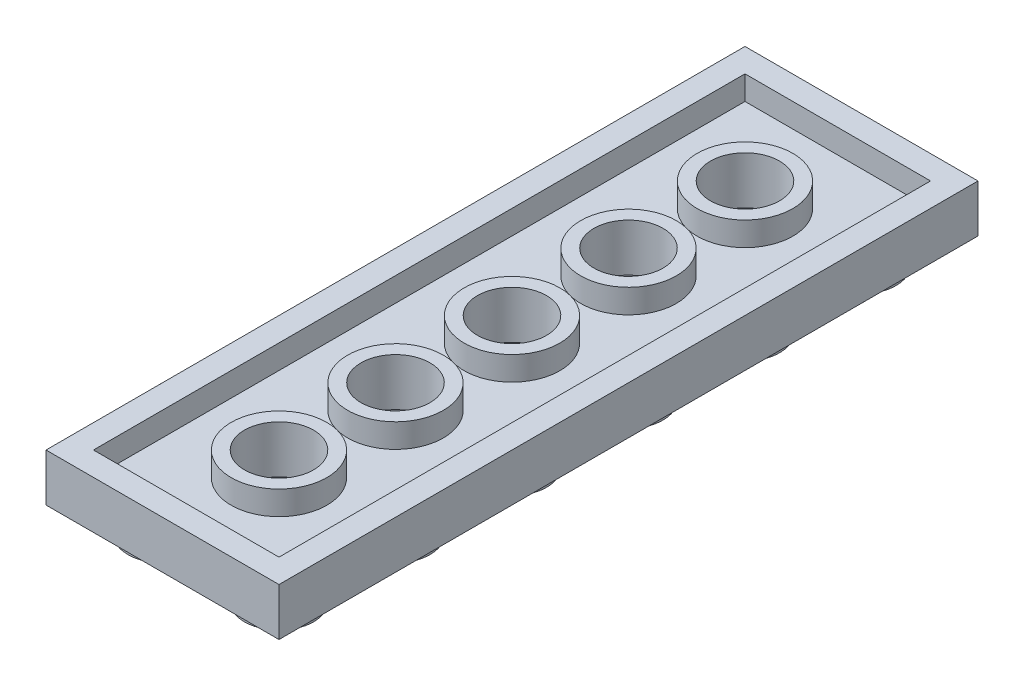
ISO-10303-21;
HEADER;
FILE_DESCRIPTION(('STEP AP214'),'2;1');
FILE_NAME('part.step','',(''),(''),'','','');
FILE_SCHEMA(('AUTOMOTIVE_DESIGN { 1 0 10303 214 1 1 1 1 }'));
ENDSEC;
DATA;
#1=APPLICATION_CONTEXT('core data for automotive mechanical design processes');
#2=APPLICATION_PROTOCOL_DEFINITION('international standard','automotive_design',2000,#1);
#3=PRODUCT_CONTEXT('',#1,'mechanical');
#4=PRODUCT('Part','Part','',(#3));
#5=PRODUCT_RELATED_PRODUCT_CATEGORY('part','',(#4));
#6=PRODUCT_DEFINITION_FORMATION('','',#4);
#7=PRODUCT_DEFINITION_CONTEXT('part definition',#1,'design');
#8=PRODUCT_DEFINITION('design','',#6,#7);
#9=PRODUCT_DEFINITION_SHAPE('','',#8);
#10=(LENGTH_UNIT() NAMED_UNIT(*) SI_UNIT(.MILLI.,.METRE.));
#11=(NAMED_UNIT(*) PLANE_ANGLE_UNIT() SI_UNIT($,.RADIAN.));
#12=(NAMED_UNIT(*) SI_UNIT($,.STERADIAN.) SOLID_ANGLE_UNIT());
#13=UNCERTAINTY_MEASURE_WITH_UNIT(LENGTH_MEASURE(1.E-05),#10,'distance_accuracy_value','');
#14=(GEOMETRIC_REPRESENTATION_CONTEXT(3) GLOBAL_UNCERTAINTY_ASSIGNED_CONTEXT((#13)) GLOBAL_UNIT_ASSIGNED_CONTEXT((#10,
#11,#12)) REPRESENTATION_CONTEXT('',''));
#15=CARTESIAN_POINT('',(0.,0.,0.));
#16=DIRECTION('',(0.,0.,1.));
#17=DIRECTION('',(1.,0.,0.));
#18=AXIS2_PLACEMENT_3D('',#15,#16,#17);
#19=CARTESIAN_POINT('',(0.,1.6425,0.));
#20=DIRECTION('',(0.,1.,0.));
#21=DIRECTION('',(0.,0.,1.));
#22=AXIS2_PLACEMENT_3D('',#19,#20,#21);
#23=PLANE('',#22);
#24=CARTESIAN_POINT('',(0.,1.6425,8.06500000000002));
#25=DIRECTION('',(0.,-1.,0.));
#26=DIRECTION('',(0.,0.,-1.));
#27=AXIS2_PLACEMENT_3D('',#24,#25,#26);
#28=CIRCLE('',#27,3.31281619026951);
#29=CARTESIAN_POINT('',(0.,1.6425,4.7521838097305));
#30=VERTEX_POINT('',#29);
#31=EDGE_CURVE('E220',#30,#30,#28,.F.);
#32=ORIENTED_EDGE('',*,*,#31,.F.);
#33=EDGE_LOOP('',(#32));
#34=FACE_BOUND('',#33,.T.);
#35=CARTESIAN_POINT('',(0.,1.6425,0.));
#36=DIRECTION('',(0.,-1.,0.));
#37=DIRECTION('',(0.,0.,-1.));
#38=AXIS2_PLACEMENT_3D('',#35,#36,#37);
#39=CIRCLE('',#38,3.31281619026951);
#40=CARTESIAN_POINT('',(0.,1.6425,-3.3128161902695));
#41=VERTEX_POINT('',#40);
#42=EDGE_CURVE('E224',#41,#41,#39,.F.);
#43=ORIENTED_EDGE('',*,*,#42,.F.);
#44=EDGE_LOOP('',(#43));
#45=FACE_BOUND('',#44,.T.);
#46=CARTESIAN_POINT('',(0.,1.6425,-8.06499999999999));
#47=DIRECTION('',(0.,-1.,0.));
#48=DIRECTION('',(0.,0.,-1.));
#49=AXIS2_PLACEMENT_3D('',#46,#47,#48);
#50=CIRCLE('',#49,3.31281619026951);
#51=CARTESIAN_POINT('',(0.,1.6425,-11.3778161902695));
#52=VERTEX_POINT('',#51);
#53=EDGE_CURVE('E227',#52,#52,#50,.F.);
#54=ORIENTED_EDGE('',*,*,#53,.F.);
#55=EDGE_LOOP('',(#54));
#56=FACE_BOUND('',#55,.T.);
#57=CARTESIAN_POINT('',(0.,1.6425,-16.13));
#58=DIRECTION('',(0.,-1.,0.));
#59=DIRECTION('',(0.,0.,-1.));
#60=AXIS2_PLACEMENT_3D('',#57,#58,#59);
#61=CIRCLE('',#60,3.31281619026951);
#62=CARTESIAN_POINT('',(0.,1.6425,-19.4428161902695));
#63=VERTEX_POINT('',#62);
#64=EDGE_CURVE('E229',#63,#63,#61,.F.);
#65=ORIENTED_EDGE('',*,*,#64,.F.);
#66=EDGE_LOOP('',(#65));
#67=FACE_BOUND('',#66,.T.);
#68=CARTESIAN_POINT('',(0.,1.6425,-24.195));
#69=DIRECTION('',(0.,-1.,0.));
#70=DIRECTION('',(0.,0.,-1.));
#71=AXIS2_PLACEMENT_3D('',#68,#69,#70);
#72=CIRCLE('',#71,3.31281619026951);
#73=CARTESIAN_POINT('',(0.,1.6425,-27.5078161902695));
#74=VERTEX_POINT('',#73);
#75=EDGE_CURVE('E19',#74,#74,#72,.F.);
#76=ORIENTED_EDGE('',*,*,#75,.F.);
#77=EDGE_LOOP('',(#76));
#78=FACE_BOUND('',#77,.T.);
#79=DIRECTION('',(-1.,0.,0.));
#80=VECTOR('',#79,1.);
#81=CARTESIAN_POINT('',(8.065,1.6425,-30.6175));
#82=LINE('',#81,#80);
#83=CARTESIAN_POINT('',(6.4225,1.6425,-30.6175));
#84=VERTEX_POINT('',#83);
#85=CARTESIAN_POINT('',(-6.4225,1.6425,-30.6175));
#86=VERTEX_POINT('',#85);
#87=EDGE_CURVE('E85',#84,#86,#82,.T.);
#88=ORIENTED_EDGE('',*,*,#87,.T.);
#89=DIRECTION('',(0.,0.,1.));
#90=VECTOR('',#89,1.);
#91=CARTESIAN_POINT('',(-6.4225,1.6425,-32.26));
#92=LINE('',#91,#90);
#93=CARTESIAN_POINT('',(-6.4225,1.6425,14.4875));
#94=VERTEX_POINT('',#93);
#95=EDGE_CURVE('E238',#86,#94,#92,.T.);
#96=ORIENTED_EDGE('',*,*,#95,.T.);
#97=DIRECTION('',(1.,0.,0.));
#98=VECTOR('',#97,1.);
#99=CARTESIAN_POINT('',(-8.065,1.6425,14.4875));
#100=LINE('',#99,#98);
#101=CARTESIAN_POINT('',(6.4225,1.6425,14.4875));
#102=VERTEX_POINT('',#101);
#103=EDGE_CURVE('E97',#94,#102,#100,.T.);
#104=ORIENTED_EDGE('',*,*,#103,.T.);
#105=DIRECTION('',(0.,0.,-1.));
#106=VECTOR('',#105,1.);
#107=CARTESIAN_POINT('',(6.4225,1.6425,16.13));
#108=LINE('',#107,#106);
#109=EDGE_CURVE('E79',#102,#84,#108,.T.);
#110=ORIENTED_EDGE('',*,*,#109,.T.);
#111=EDGE_LOOP('',(#88,#96,#104,#110));
#112=FACE_BOUND('',#111,.T.);
#113=ADVANCED_FACE('F16',(#34,#45,#56,#67,#78,#112),#23,.T.);
#114=CARTESIAN_POINT('',(8.065,0.,-30.6175));
#115=DIRECTION('',(0.,0.,-1.));
#116=DIRECTION('',(-1.,0.,0.));
#117=AXIS2_PLACEMENT_3D('',#114,#115,#116);
#118=PLANE('',#117);
#119=ORIENTED_EDGE('',*,*,#87,.F.);
#120=DIRECTION('',(0.,1.,0.));
#121=VECTOR('',#120,1.);
#122=CARTESIAN_POINT('',(6.4225,0.,-30.6175));
#123=LINE('',#122,#121);
#124=CARTESIAN_POINT('',(6.4225,3.3,-30.6175));
#125=VERTEX_POINT('',#124);
#126=EDGE_CURVE('E88',#84,#125,#123,.T.);
#127=ORIENTED_EDGE('',*,*,#126,.T.);
#128=DIRECTION('',(1.,0.,0.));
#129=VECTOR('',#128,1.);
#130=CARTESIAN_POINT('',(0.,3.3,-30.6175));
#131=LINE('',#130,#129);
#132=CARTESIAN_POINT('',(-6.4225,3.3,-30.6175));
#133=VERTEX_POINT('',#132);
#134=EDGE_CURVE('E223',#133,#125,#131,.T.);
#135=ORIENTED_EDGE('',*,*,#134,.F.);
#136=DIRECTION('',(0.,1.,0.));
#137=VECTOR('',#136,1.);
#138=CARTESIAN_POINT('',(-6.4225,0.,-30.6175));
#139=LINE('',#138,#137);
#140=EDGE_CURVE('E90',#133,#86,#139,.F.);
#141=ORIENTED_EDGE('',*,*,#140,.T.);
#142=EDGE_LOOP('',(#119,#127,#135,#141));
#143=FACE_BOUND('',#142,.T.);
#144=ADVANCED_FACE('F86',(#143),#118,.F.);
#145=CARTESIAN_POINT('',(6.4225,0.,16.13));
#146=DIRECTION('',(1.,0.,0.));
#147=DIRECTION('',(0.,0.,-1.));
#148=AXIS2_PLACEMENT_3D('',#145,#146,#147);
#149=PLANE('',#148);
#150=ORIENTED_EDGE('',*,*,#109,.F.);
#151=DIRECTION('',(0.,1.,0.));
#152=VECTOR('',#151,1.);
#153=CARTESIAN_POINT('',(6.4225,0.,14.4875));
#154=LINE('',#153,#152);
#155=CARTESIAN_POINT('',(6.4225,3.3,14.4875));
#156=VERTEX_POINT('',#155);
#157=EDGE_CURVE('E249',#102,#156,#154,.T.);
#158=ORIENTED_EDGE('',*,*,#157,.T.);
#159=DIRECTION('',(0.,0.,1.));
#160=VECTOR('',#159,1.);
#161=CARTESIAN_POINT('',(6.4225,3.3,0.));
#162=LINE('',#161,#160);
#163=EDGE_CURVE('E96',#125,#156,#162,.T.);
#164=ORIENTED_EDGE('',*,*,#163,.F.);
#165=ORIENTED_EDGE('',*,*,#126,.F.);
#166=EDGE_LOOP('',(#150,#158,#164,#165));
#167=FACE_BOUND('',#166,.T.);
#168=ADVANCED_FACE('F95',(#167),#149,.F.);
#169=CARTESIAN_POINT('',(-8.065,0.,14.4875));
#170=DIRECTION('',(0.,0.,1.));
#171=DIRECTION('',(1.,0.,0.));
#172=AXIS2_PLACEMENT_3D('',#169,#170,#171);
#173=PLANE('',#172);
#174=ORIENTED_EDGE('',*,*,#103,.F.);
#175=DIRECTION('',(0.,1.,0.));
#176=VECTOR('',#175,1.);
#177=CARTESIAN_POINT('',(-6.4225,0.,14.4875));
#178=LINE('',#177,#176);
#179=CARTESIAN_POINT('',(-6.4225,3.3,14.4875));
#180=VERTEX_POINT('',#179);
#181=EDGE_CURVE('E234',#94,#180,#178,.T.);
#182=ORIENTED_EDGE('',*,*,#181,.T.);
#183=DIRECTION('',(1.,0.,0.));
#184=VECTOR('',#183,1.);
#185=CARTESIAN_POINT('',(0.,3.3,14.4875));
#186=LINE('',#185,#184);
#187=EDGE_CURVE('E250',#156,#180,#186,.F.);
#188=ORIENTED_EDGE('',*,*,#187,.F.);
#189=ORIENTED_EDGE('',*,*,#157,.F.);
#190=EDGE_LOOP('',(#174,#182,#188,#189));
#191=FACE_BOUND('',#190,.T.);
#192=ADVANCED_FACE('F251',(#191),#173,.F.);
#193=CARTESIAN_POINT('',(-6.4225,0.,-32.26));
#194=DIRECTION('',(-1.,0.,0.));
#195=DIRECTION('',(0.,0.,1.));
#196=AXIS2_PLACEMENT_3D('',#193,#194,#195);
#197=PLANE('',#196);
#198=ORIENTED_EDGE('',*,*,#95,.F.);
#199=ORIENTED_EDGE('',*,*,#140,.F.);
#200=DIRECTION('',(0.,0.,1.));
#201=VECTOR('',#200,1.);
#202=CARTESIAN_POINT('',(-6.4225,3.3,0.));
#203=LINE('',#202,#201);
#204=EDGE_CURVE('E219',#180,#133,#203,.F.);
#205=ORIENTED_EDGE('',*,*,#204,.F.);
#206=ORIENTED_EDGE('',*,*,#181,.F.);
#207=EDGE_LOOP('',(#198,#199,#205,#206));
#208=FACE_BOUND('',#207,.T.);
#209=ADVANCED_FACE('F765',(#208),#197,.F.);
#210=CARTESIAN_POINT('',(0.,0.,-24.195));
#211=DIRECTION('',(0.,-1.,0.));
#212=DIRECTION('',(0.,0.,-1.));
#213=AXIS2_PLACEMENT_3D('',#210,#211,#212);
#214=CYLINDRICAL_SURFACE('',#213,3.31281619026951);
#215=ORIENTED_EDGE('',*,*,#75,.T.);
#216=EDGE_LOOP('',(#215));
#217=FACE_BOUND('',#216,.T.);
#218=CARTESIAN_POINT('',(0.,3.3,-24.195));
#219=DIRECTION('',(0.,-1.,0.));
#220=DIRECTION('',(0.,0.,-1.));
#221=AXIS2_PLACEMENT_3D('',#218,#219,#220);
#222=CIRCLE('',#221,3.31281619026951);
#223=CARTESIAN_POINT('',(0.,3.3,-27.5078161902695));
#224=VERTEX_POINT('',#223);
#225=EDGE_CURVE('E216',#224,#224,#222,.F.);
#226=ORIENTED_EDGE('',*,*,#225,.F.);
#227=EDGE_LOOP('',(#226));
#228=FACE_BOUND('',#227,.T.);
#229=ADVANCED_FACE('F759',(#217,#228),#214,.T.);
#230=CARTESIAN_POINT('',(0.,0.,-16.13));
#231=DIRECTION('',(0.,-1.,0.));
#232=DIRECTION('',(0.,0.,-1.));
#233=AXIS2_PLACEMENT_3D('',#230,#231,#232);
#234=CYLINDRICAL_SURFACE('',#233,3.31281619026951);
#235=ORIENTED_EDGE('',*,*,#64,.T.);
#236=EDGE_LOOP('',(#235));
#237=FACE_BOUND('',#236,.T.);
#238=CARTESIAN_POINT('',(0.,3.3,-16.13));
#239=DIRECTION('',(0.,-1.,0.));
#240=DIRECTION('',(0.,0.,-1.));
#241=AXIS2_PLACEMENT_3D('',#238,#239,#240);
#242=CIRCLE('',#241,3.31281619026951);
#243=CARTESIAN_POINT('',(0.,3.3,-19.4428161902695));
#244=VERTEX_POINT('',#243);
#245=EDGE_CURVE('E213',#244,#244,#242,.F.);
#246=ORIENTED_EDGE('',*,*,#245,.F.);
#247=EDGE_LOOP('',(#246));
#248=FACE_BOUND('',#247,.T.);
#249=ADVANCED_FACE('F752',(#237,#248),#234,.T.);
#250=CARTESIAN_POINT('',(0.,0.,-8.06499999999999));
#251=DIRECTION('',(0.,-1.,0.));
#252=DIRECTION('',(0.,0.,-1.));
#253=AXIS2_PLACEMENT_3D('',#250,#251,#252);
#254=CYLINDRICAL_SURFACE('',#253,3.31281619026951);
#255=ORIENTED_EDGE('',*,*,#53,.T.);
#256=EDGE_LOOP('',(#255));
#257=FACE_BOUND('',#256,.T.);
#258=CARTESIAN_POINT('',(0.,3.3,-8.06499999999999));
#259=DIRECTION('',(0.,-1.,0.));
#260=DIRECTION('',(0.,0.,-1.));
#261=AXIS2_PLACEMENT_3D('',#258,#259,#260);
#262=CIRCLE('',#261,3.31281619026951);
#263=CARTESIAN_POINT('',(0.,3.3,-11.3778161902695));
#264=VERTEX_POINT('',#263);
#265=EDGE_CURVE('E210',#264,#264,#262,.F.);
#266=ORIENTED_EDGE('',*,*,#265,.F.);
#267=EDGE_LOOP('',(#266));
#268=FACE_BOUND('',#267,.T.);
#269=ADVANCED_FACE('F745',(#257,#268),#254,.T.);
#270=CARTESIAN_POINT('',(0.,0.,0.));
#271=DIRECTION('',(0.,-1.,0.));
#272=DIRECTION('',(0.,0.,-1.));
#273=AXIS2_PLACEMENT_3D('',#270,#271,#272);
#274=CYLINDRICAL_SURFACE('',#273,3.31281619026951);
#275=ORIENTED_EDGE('',*,*,#42,.T.);
#276=EDGE_LOOP('',(#275));
#277=FACE_BOUND('',#276,.T.);
#278=CARTESIAN_POINT('',(0.,3.3,0.));
#279=DIRECTION('',(0.,-1.,0.));
#280=DIRECTION('',(0.,0.,-1.));
#281=AXIS2_PLACEMENT_3D('',#278,#279,#280);
#282=CIRCLE('',#281,3.31281619026951);
#283=CARTESIAN_POINT('',(0.,3.3,-3.3128161902695));
#284=VERTEX_POINT('',#283);
#285=EDGE_CURVE('E207',#284,#284,#282,.F.);
#286=ORIENTED_EDGE('',*,*,#285,.F.);
#287=EDGE_LOOP('',(#286));
#288=FACE_BOUND('',#287,.T.);
#289=ADVANCED_FACE('F312',(#277,#288),#274,.T.);
#290=CARTESIAN_POINT('',(0.,0.,8.06500000000002));
#291=DIRECTION('',(0.,-1.,0.));
#292=DIRECTION('',(0.,0.,-1.));
#293=AXIS2_PLACEMENT_3D('',#290,#291,#292);
#294=CYLINDRICAL_SURFACE('',#293,3.31281619026951);
#295=ORIENTED_EDGE('',*,*,#31,.T.);
#296=EDGE_LOOP('',(#295));
#297=FACE_BOUND('',#296,.T.);
#298=CARTESIAN_POINT('',(0.,3.3,8.06500000000002));
#299=DIRECTION('',(0.,-1.,0.));
#300=DIRECTION('',(0.,0.,-1.));
#301=AXIS2_PLACEMENT_3D('',#298,#299,#300);
#302=CIRCLE('',#301,3.31281619026951);
#303=CARTESIAN_POINT('',(0.,3.3,4.7521838097305));
#304=VERTEX_POINT('',#303);
#305=EDGE_CURVE('E203',#304,#304,#302,.F.);
#306=ORIENTED_EDGE('',*,*,#305,.F.);
#307=EDGE_LOOP('',(#306));
#308=FACE_BOUND('',#307,.T.);
#309=ADVANCED_FACE('F302',(#297,#308),#294,.T.);
#310=CARTESIAN_POINT('',(0.,3.3,0.));
#311=DIRECTION('',(0.,1.,0.));
#312=DIRECTION('',(0.,0.,1.));
#313=AXIS2_PLACEMENT_3D('',#310,#311,#312);
#314=PLANE('',#313);
#315=ORIENTED_EDGE('',*,*,#187,.T.);
#316=ORIENTED_EDGE('',*,*,#204,.T.);
#317=ORIENTED_EDGE('',*,*,#134,.T.);
#318=ORIENTED_EDGE('',*,*,#163,.T.);
#319=EDGE_LOOP('',(#315,#316,#317,#318));
#320=FACE_BOUND('',#319,.T.);
#321=DIRECTION('',(-1.,0.,0.));
#322=VECTOR('',#321,1.);
#323=CARTESIAN_POINT('',(8.065,3.3,-32.26));
#324=LINE('',#323,#322);
#325=CARTESIAN_POINT('',(-8.065,3.3,-32.26));
#326=VERTEX_POINT('',#325);
#327=CARTESIAN_POINT('',(8.065,3.3,-32.26));
#328=VERTEX_POINT('',#327);
#329=EDGE_CURVE('E269',#326,#328,#324,.F.);
#330=ORIENTED_EDGE('',*,*,#329,.F.);
#331=DIRECTION('',(0.,0.,1.));
#332=VECTOR('',#331,1.);
#333=CARTESIAN_POINT('',(-8.065,3.3,-32.26));
#334=LINE('',#333,#332);
#335=CARTESIAN_POINT('',(-8.065,3.3,16.13));
#336=VERTEX_POINT('',#335);
#337=EDGE_CURVE('E206',#336,#326,#334,.F.);
#338=ORIENTED_EDGE('',*,*,#337,.F.);
#339=DIRECTION('',(1.,0.,0.));
#340=VECTOR('',#339,1.);
#341=CARTESIAN_POINT('',(-8.065,3.3,16.13));
#342=LINE('',#341,#340);
#343=CARTESIAN_POINT('',(8.065,3.3,16.13));
#344=VERTEX_POINT('',#343);
#345=EDGE_CURVE('E258',#344,#336,#342,.F.);
#346=ORIENTED_EDGE('',*,*,#345,.F.);
#347=DIRECTION('',(0.,0.,-1.));
#348=VECTOR('',#347,1.);
#349=CARTESIAN_POINT('',(8.065,3.3,16.13));
#350=LINE('',#349,#348);
#351=EDGE_CURVE('E262',#328,#344,#350,.F.);
#352=ORIENTED_EDGE('',*,*,#351,.F.);
#353=EDGE_LOOP('',(#330,#338,#346,#352));
#354=FACE_BOUND('',#353,.T.);
#355=ADVANCED_FACE('F299',(#320,#354),#314,.T.);
#356=CARTESIAN_POINT('',(0.,-1.78,0.));
#357=DIRECTION('',(0.,1.,0.));
#358=DIRECTION('',(0.,0.,1.));
#359=AXIS2_PLACEMENT_3D('',#356,#357,#358);
#360=PLANE('',#359);
#361=CARTESIAN_POINT('',(4.03250000000001,-1.78,-28.2275));
#362=DIRECTION('',(0.,1.,0.));
#363=DIRECTION('',(0.,0.,1.));
#364=AXIS2_PLACEMENT_3D('',#361,#362,#363);
#365=CIRCLE('',#364,2.39);
#366=CARTESIAN_POINT('',(4.03250000000001,-1.78,-25.8375));
#367=VERTEX_POINT('',#366);
#368=EDGE_CURVE('E200',#367,#367,#365,.T.);
#369=ORIENTED_EDGE('',*,*,#368,.F.);
#370=EDGE_LOOP('',(#369));
#371=FACE_BOUND('',#370,.T.);
#372=ADVANCED_FACE('F301',(#371),#360,.F.);
#373=CARTESIAN_POINT('',(-8.065,-1.78,0.));
#374=DIRECTION('',(0.,1.,0.));
#375=DIRECTION('',(0.,0.,1.));
#376=AXIS2_PLACEMENT_3D('',#373,#374,#375);
#377=PLANE('',#376);
#378=CARTESIAN_POINT('',(-4.0325,-1.78,-28.2275));
#379=DIRECTION('',(0.,1.,0.));
#380=DIRECTION('',(0.,0.,1.));
#381=AXIS2_PLACEMENT_3D('',#378,#379,#380);
#382=CIRCLE('',#381,2.39);
#383=CARTESIAN_POINT('',(-4.0325,-1.78,-25.8375));
#384=VERTEX_POINT('',#383);
#385=EDGE_CURVE('E197',#384,#384,#382,.T.);
#386=ORIENTED_EDGE('',*,*,#385,.F.);
#387=EDGE_LOOP('',(#386));
#388=FACE_BOUND('',#387,.T.);
#389=ADVANCED_FACE('F309',(#388),#377,.F.);
#390=CARTESIAN_POINT('',(0.,-1.78,8.065));
#391=DIRECTION('',(0.,1.,0.));
#392=DIRECTION('',(0.,0.,1.));
#393=AXIS2_PLACEMENT_3D('',#390,#391,#392);
#394=PLANE('',#393);
#395=CARTESIAN_POINT('',(4.03250000000001,-1.78,-20.1625));
#396=DIRECTION('',(0.,1.,0.));
#397=DIRECTION('',(0.,0.,1.));
#398=AXIS2_PLACEMENT_3D('',#395,#396,#397);
#399=CIRCLE('',#398,2.39);
#400=CARTESIAN_POINT('',(4.03250000000001,-1.78,-17.7725));
#401=VERTEX_POINT('',#400);
#402=EDGE_CURVE('E194',#401,#401,#399,.T.);
#403=ORIENTED_EDGE('',*,*,#402,.F.);
#404=EDGE_LOOP('',(#403));
#405=FACE_BOUND('',#404,.T.);
#406=ADVANCED_FACE('F454',(#405),#394,.F.);
#407=CARTESIAN_POINT('',(-8.065,-1.78,8.065));
#408=DIRECTION('',(0.,1.,0.));
#409=DIRECTION('',(0.,0.,1.));
#410=AXIS2_PLACEMENT_3D('',#407,#408,#409);
#411=PLANE('',#410);
#412=CARTESIAN_POINT('',(-4.0325,-1.78,-20.1625));
#413=DIRECTION('',(0.,1.,0.));
#414=DIRECTION('',(0.,0.,1.));
#415=AXIS2_PLACEMENT_3D('',#412,#413,#414);
#416=CIRCLE('',#415,2.39);
#417=CARTESIAN_POINT('',(-4.0325,-1.78,-17.7725));
#418=VERTEX_POINT('',#417);
#419=EDGE_CURVE('E191',#418,#418,#416,.T.);
#420=ORIENTED_EDGE('',*,*,#419,.F.);
#421=EDGE_LOOP('',(#420));
#422=FACE_BOUND('',#421,.T.);
#423=ADVANCED_FACE('F450',(#422),#411,.F.);
#424=CARTESIAN_POINT('',(0.,-1.78,16.13));
#425=DIRECTION('',(0.,1.,0.));
#426=DIRECTION('',(0.,0.,1.));
#427=AXIS2_PLACEMENT_3D('',#424,#425,#426);
#428=PLANE('',#427);
#429=CARTESIAN_POINT('',(4.03250000000001,-1.78,-12.0975));
#430=DIRECTION('',(0.,1.,0.));
#431=DIRECTION('',(0.,0.,1.));
#432=AXIS2_PLACEMENT_3D('',#429,#430,#431);
#433=CIRCLE('',#432,2.39);
#434=CARTESIAN_POINT('',(4.03250000000001,-1.78,-9.70749999999999));
#435=VERTEX_POINT('',#434);
#436=EDGE_CURVE('E188',#435,#435,#433,.T.);
#437=ORIENTED_EDGE('',*,*,#436,.F.);
#438=EDGE_LOOP('',(#437));
#439=FACE_BOUND('',#438,.T.);
#440=ADVANCED_FACE('F446',(#439),#428,.F.);
#441=CARTESIAN_POINT('',(-8.065,-1.78,16.13));
#442=DIRECTION('',(0.,1.,0.));
#443=DIRECTION('',(0.,0.,1.));
#444=AXIS2_PLACEMENT_3D('',#441,#442,#443);
#445=PLANE('',#444);
#446=CARTESIAN_POINT('',(-4.0325,-1.78,-12.0975));
#447=DIRECTION('',(0.,1.,0.));
#448=DIRECTION('',(0.,0.,1.));
#449=AXIS2_PLACEMENT_3D('',#446,#447,#448);
#450=CIRCLE('',#449,2.39);
#451=CARTESIAN_POINT('',(-4.0325,-1.78,-9.70749999999999));
#452=VERTEX_POINT('',#451);
#453=EDGE_CURVE('E185',#452,#452,#450,.T.);
#454=ORIENTED_EDGE('',*,*,#453,.F.);
#455=EDGE_LOOP('',(#454));
#456=FACE_BOUND('',#455,.T.);
#457=ADVANCED_FACE('F442',(#456),#445,.F.);
#458=CARTESIAN_POINT('',(0.,-1.78,24.195));
#459=DIRECTION('',(0.,1.,0.));
#460=DIRECTION('',(0.,0.,1.));
#461=AXIS2_PLACEMENT_3D('',#458,#459,#460);
#462=PLANE('',#461);
#463=CARTESIAN_POINT('',(4.03250000000001,-1.78,-4.03249999999999));
#464=DIRECTION('',(0.,1.,0.));
#465=DIRECTION('',(0.,0.,1.));
#466=AXIS2_PLACEMENT_3D('',#463,#464,#465);
#467=CIRCLE('',#466,2.39);
#468=CARTESIAN_POINT('',(4.03250000000001,-1.78,-1.64249999999999));
#469=VERTEX_POINT('',#468);
#470=EDGE_CURVE('E182',#469,#469,#467,.T.);
#471=ORIENTED_EDGE('',*,*,#470,.F.);
#472=EDGE_LOOP('',(#471));
#473=FACE_BOUND('',#472,.T.);
#474=ADVANCED_FACE('F438',(#473),#462,.F.);
#475=CARTESIAN_POINT('',(-8.065,-1.78,24.195));
#476=DIRECTION('',(0.,1.,0.));
#477=DIRECTION('',(0.,0.,1.));
#478=AXIS2_PLACEMENT_3D('',#475,#476,#477);
#479=PLANE('',#478);
#480=CARTESIAN_POINT('',(-4.0325,-1.78,-4.03249999999999));
#481=DIRECTION('',(0.,1.,0.));
#482=DIRECTION('',(0.,0.,1.));
#483=AXIS2_PLACEMENT_3D('',#480,#481,#482);
#484=CIRCLE('',#483,2.39);
#485=CARTESIAN_POINT('',(-4.0325,-1.78,-1.64249999999999));
#486=VERTEX_POINT('',#485);
#487=EDGE_CURVE('E179',#486,#486,#484,.T.);
#488=ORIENTED_EDGE('',*,*,#487,.F.);
#489=EDGE_LOOP('',(#488));
#490=FACE_BOUND('',#489,.T.);
#491=ADVANCED_FACE('F434',(#490),#479,.F.);
#492=CARTESIAN_POINT('',(0.,-1.78,32.26));
#493=DIRECTION('',(0.,1.,0.));
#494=DIRECTION('',(0.,0.,1.));
#495=AXIS2_PLACEMENT_3D('',#492,#493,#494);
#496=PLANE('',#495);
#497=CARTESIAN_POINT('',(4.03250000000001,-1.78,4.03250000000001));
#498=DIRECTION('',(0.,1.,0.));
#499=DIRECTION('',(0.,0.,1.));
#500=AXIS2_PLACEMENT_3D('',#497,#498,#499);
#501=CIRCLE('',#500,2.39);
#502=CARTESIAN_POINT('',(4.03250000000001,-1.78,6.42250000000001));
#503=VERTEX_POINT('',#502);
#504=EDGE_CURVE('E176',#503,#503,#501,.T.);
#505=ORIENTED_EDGE('',*,*,#504,.F.);
#506=EDGE_LOOP('',(#505));
#507=FACE_BOUND('',#506,.T.);
#508=ADVANCED_FACE('F430',(#507),#496,.F.);
#509=CARTESIAN_POINT('',(-8.065,-1.78,32.26));
#510=DIRECTION('',(0.,1.,0.));
#511=DIRECTION('',(0.,0.,1.));
#512=AXIS2_PLACEMENT_3D('',#509,#510,#511);
#513=PLANE('',#512);
#514=CARTESIAN_POINT('',(-4.0325,-1.78,4.03250000000001));
#515=DIRECTION('',(0.,1.,0.));
#516=DIRECTION('',(0.,0.,1.));
#517=AXIS2_PLACEMENT_3D('',#514,#515,#516);
#518=CIRCLE('',#517,2.39);
#519=CARTESIAN_POINT('',(-4.0325,-1.78,6.42250000000001));
#520=VERTEX_POINT('',#519);
#521=EDGE_CURVE('E173',#520,#520,#518,.T.);
#522=ORIENTED_EDGE('',*,*,#521,.F.);
#523=EDGE_LOOP('',(#522));
#524=FACE_BOUND('',#523,.T.);
#525=ADVANCED_FACE('F426',(#524),#513,.F.);
#526=CARTESIAN_POINT('',(0.,-1.78,40.325));
#527=DIRECTION('',(0.,1.,0.));
#528=DIRECTION('',(0.,0.,1.));
#529=AXIS2_PLACEMENT_3D('',#526,#527,#528);
#530=PLANE('',#529);
#531=CARTESIAN_POINT('',(4.03250000000001,-1.78,12.0975));
#532=DIRECTION('',(0.,1.,0.));
#533=DIRECTION('',(0.,0.,1.));
#534=AXIS2_PLACEMENT_3D('',#531,#532,#533);
#535=CIRCLE('',#534,2.39);
#536=CARTESIAN_POINT('',(4.03250000000001,-1.78,14.4875));
#537=VERTEX_POINT('',#536);
#538=EDGE_CURVE('E170',#537,#537,#535,.T.);
#539=ORIENTED_EDGE('',*,*,#538,.F.);
#540=EDGE_LOOP('',(#539));
#541=FACE_BOUND('',#540,.T.);
#542=ADVANCED_FACE('F422',(#541),#530,.F.);
#543=CARTESIAN_POINT('',(-8.065,-1.78,40.325));
#544=DIRECTION('',(0.,1.,0.));
#545=DIRECTION('',(0.,0.,1.));
#546=AXIS2_PLACEMENT_3D('',#543,#544,#545);
#547=PLANE('',#546);
#548=CARTESIAN_POINT('',(-4.0325,-1.78,12.0975));
#549=DIRECTION('',(0.,1.,0.));
#550=DIRECTION('',(0.,0.,1.));
#551=AXIS2_PLACEMENT_3D('',#548,#549,#550);
#552=CIRCLE('',#551,2.39);
#553=CARTESIAN_POINT('',(-4.0325,-1.78,14.4875));
#554=VERTEX_POINT('',#553);
#555=EDGE_CURVE('E167',#554,#554,#552,.T.);
#556=ORIENTED_EDGE('',*,*,#555,.F.);
#557=EDGE_LOOP('',(#556));
#558=FACE_BOUND('',#557,.T.);
#559=ADVANCED_FACE('F418',(#558),#547,.F.);
#560=CARTESIAN_POINT('',(0.,3.3,0.));
#561=DIRECTION('',(0.,1.,0.));
#562=DIRECTION('',(0.,0.,1.));
#563=AXIS2_PLACEMENT_3D('',#560,#561,#562);
#564=PLANE('',#563);
#565=CARTESIAN_POINT('',(0.,3.3,-24.195));
#566=DIRECTION('',(0.,-1.,0.));
#567=DIRECTION('',(0.,0.,-1.));
#568=AXIS2_PLACEMENT_3D('',#565,#566,#567);
#569=CIRCLE('',#568,2.39);
#570=CARTESIAN_POINT('',(0.,3.3,-26.585));
#571=VERTEX_POINT('',#570);
#572=EDGE_CURVE('E164',#571,#571,#569,.T.);
#573=ORIENTED_EDGE('',*,*,#572,.T.);
#574=EDGE_LOOP('',(#573));
#575=FACE_BOUND('',#574,.T.);
#576=ORIENTED_EDGE('',*,*,#225,.T.);
#577=EDGE_LOOP('',(#576));
#578=FACE_BOUND('',#577,.T.);
#579=ADVANCED_FACE('F414',(#575,#578),#564,.T.);
#580=CARTESIAN_POINT('',(0.,3.3,8.065));
#581=DIRECTION('',(0.,1.,0.));
#582=DIRECTION('',(0.,0.,1.));
#583=AXIS2_PLACEMENT_3D('',#580,#581,#582);
#584=PLANE('',#583);
#585=CARTESIAN_POINT('',(0.,3.3,-16.13));
#586=DIRECTION('',(0.,-1.,0.));
#587=DIRECTION('',(0.,0.,-1.));
#588=AXIS2_PLACEMENT_3D('',#585,#586,#587);
#589=CIRCLE('',#588,2.39);
#590=CARTESIAN_POINT('',(0.,3.3,-18.52));
#591=VERTEX_POINT('',#590);
#592=EDGE_CURVE('E161',#591,#591,#589,.T.);
#593=ORIENTED_EDGE('',*,*,#592,.T.);
#594=EDGE_LOOP('',(#593));
#595=FACE_BOUND('',#594,.T.);
#596=ORIENTED_EDGE('',*,*,#245,.T.);
#597=EDGE_LOOP('',(#596));
#598=FACE_BOUND('',#597,.T.);
#599=ADVANCED_FACE('F410',(#595,#598),#584,.T.);
#600=CARTESIAN_POINT('',(0.,3.3,16.13));
#601=DIRECTION('',(0.,1.,0.));
#602=DIRECTION('',(0.,0.,1.));
#603=AXIS2_PLACEMENT_3D('',#600,#601,#602);
#604=PLANE('',#603);
#605=CARTESIAN_POINT('',(0.,3.3,-8.06499999999999));
#606=DIRECTION('',(0.,-1.,0.));
#607=DIRECTION('',(0.,0.,-1.));
#608=AXIS2_PLACEMENT_3D('',#605,#606,#607);
#609=CIRCLE('',#608,2.39);
#610=CARTESIAN_POINT('',(0.,3.3,-10.455));
#611=VERTEX_POINT('',#610);
#612=EDGE_CURVE('E158',#611,#611,#609,.T.);
#613=ORIENTED_EDGE('',*,*,#612,.T.);
#614=EDGE_LOOP('',(#613));
#615=FACE_BOUND('',#614,.T.);
#616=ORIENTED_EDGE('',*,*,#265,.T.);
#617=EDGE_LOOP('',(#616));
#618=FACE_BOUND('',#617,.T.);
#619=ADVANCED_FACE('F406',(#615,#618),#604,.T.);
#620=CARTESIAN_POINT('',(0.,3.3,24.195));
#621=DIRECTION('',(0.,1.,0.));
#622=DIRECTION('',(0.,0.,1.));
#623=AXIS2_PLACEMENT_3D('',#620,#621,#622);
#624=PLANE('',#623);
#625=CARTESIAN_POINT('',(0.,3.3,0.));
#626=DIRECTION('',(0.,-1.,0.));
#627=DIRECTION('',(0.,0.,-1.));
#628=AXIS2_PLACEMENT_3D('',#625,#626,#627);
#629=CIRCLE('',#628,2.39);
#630=CARTESIAN_POINT('',(0.,3.3,-2.38999999999999));
#631=VERTEX_POINT('',#630);
#632=EDGE_CURVE('E155',#631,#631,#629,.T.);
#633=ORIENTED_EDGE('',*,*,#632,.T.);
#634=EDGE_LOOP('',(#633));
#635=FACE_BOUND('',#634,.T.);
#636=ORIENTED_EDGE('',*,*,#285,.T.);
#637=EDGE_LOOP('',(#636));
#638=FACE_BOUND('',#637,.T.);
#639=ADVANCED_FACE('F402',(#635,#638),#624,.T.);
#640=CARTESIAN_POINT('',(0.,3.3,32.26));
#641=DIRECTION('',(0.,1.,0.));
#642=DIRECTION('',(0.,0.,1.));
#643=AXIS2_PLACEMENT_3D('',#640,#641,#642);
#644=PLANE('',#643);
#645=CARTESIAN_POINT('',(0.,3.3,8.06500000000002));
#646=DIRECTION('',(0.,-1.,0.));
#647=DIRECTION('',(0.,0.,-1.));
#648=AXIS2_PLACEMENT_3D('',#645,#646,#647);
#649=CIRCLE('',#648,2.39);
#650=CARTESIAN_POINT('',(0.,3.3,5.67500000000001));
#651=VERTEX_POINT('',#650);
#652=EDGE_CURVE('E151',#651,#651,#649,.T.);
#653=ORIENTED_EDGE('',*,*,#652,.T.);
#654=EDGE_LOOP('',(#653));
#655=FACE_BOUND('',#654,.T.);
#656=ORIENTED_EDGE('',*,*,#305,.T.);
#657=EDGE_LOOP('',(#656));
#658=FACE_BOUND('',#657,.T.);
#659=ADVANCED_FACE('F399',(#655,#658),#644,.T.);
#660=CARTESIAN_POINT('',(-8.065,0.,-32.26));
#661=DIRECTION('',(-1.,0.,0.));
#662=DIRECTION('',(0.,0.,1.));
#663=AXIS2_PLACEMENT_3D('',#660,#661,#662);
#664=PLANE('',#663);
#665=DIRECTION('',(0.,1.,0.));
#666=VECTOR('',#665,1.);
#667=CARTESIAN_POINT('',(-8.065,0.,-32.26));
#668=LINE('',#667,#666);
#669=CARTESIAN_POINT('',(-8.065,0.,-32.26));
#670=VERTEX_POINT('',#669);
#671=EDGE_CURVE('E266',#670,#326,#668,.T.);
#672=ORIENTED_EDGE('',*,*,#671,.F.);
#673=DIRECTION('',(0.,0.,1.));
#674=VECTOR('',#673,1.);
#675=CARTESIAN_POINT('',(-8.065,0.,0.));
#676=LINE('',#675,#674);
#677=CARTESIAN_POINT('',(-8.065,0.,16.13));
#678=VERTEX_POINT('',#677);
#679=EDGE_CURVE('E154',#670,#678,#676,.T.);
#680=ORIENTED_EDGE('',*,*,#679,.T.);
#681=DIRECTION('',(0.,1.,0.));
#682=VECTOR('',#681,1.);
#683=CARTESIAN_POINT('',(-8.065,0.,16.13));
#684=LINE('',#683,#682);
#685=EDGE_CURVE('E260',#336,#678,#684,.F.);
#686=ORIENTED_EDGE('',*,*,#685,.F.);
#687=ORIENTED_EDGE('',*,*,#337,.T.);
#688=EDGE_LOOP('',(#672,#680,#686,#687));
#689=FACE_BOUND('',#688,.T.);
#690=ADVANCED_FACE('F297',(#689),#664,.T.);
#691=CARTESIAN_POINT('',(-8.065,0.,16.13));
#692=DIRECTION('',(0.,0.,1.));
#693=DIRECTION('',(1.,0.,0.));
#694=AXIS2_PLACEMENT_3D('',#691,#692,#693);
#695=PLANE('',#694);
#696=ORIENTED_EDGE('',*,*,#685,.T.);
#697=DIRECTION('',(1.,0.,0.));
#698=VECTOR('',#697,1.);
#699=CARTESIAN_POINT('',(0.,0.,16.13));
#700=LINE('',#699,#698);
#701=CARTESIAN_POINT('',(8.065,0.,16.13));
#702=VERTEX_POINT('',#701);
#703=EDGE_CURVE('E274',#678,#702,#700,.T.);
#704=ORIENTED_EDGE('',*,*,#703,.T.);
#705=DIRECTION('',(0.,1.,0.));
#706=VECTOR('',#705,1.);
#707=CARTESIAN_POINT('',(8.065,0.,16.13));
#708=LINE('',#707,#706);
#709=EDGE_CURVE('E264',#344,#702,#708,.F.);
#710=ORIENTED_EDGE('',*,*,#709,.F.);
#711=ORIENTED_EDGE('',*,*,#345,.T.);
#712=EDGE_LOOP('',(#696,#704,#710,#711));
#713=FACE_BOUND('',#712,.T.);
#714=ADVANCED_FACE('F293',(#713),#695,.T.);
#715=CARTESIAN_POINT('',(8.065,0.,16.13));
#716=DIRECTION('',(1.,0.,0.));
#717=DIRECTION('',(0.,0.,-1.));
#718=AXIS2_PLACEMENT_3D('',#715,#716,#717);
#719=PLANE('',#718);
#720=ORIENTED_EDGE('',*,*,#709,.T.);
#721=DIRECTION('',(0.,0.,1.));
#722=VECTOR('',#721,1.);
#723=CARTESIAN_POINT('',(8.065,0.,0.));
#724=LINE('',#723,#722);
#725=CARTESIAN_POINT('',(8.065,0.,-32.26));
#726=VERTEX_POINT('',#725);
#727=EDGE_CURVE('E277',#702,#726,#724,.F.);
#728=ORIENTED_EDGE('',*,*,#727,.T.);
#729=DIRECTION('',(0.,1.,0.));
#730=VECTOR('',#729,1.);
#731=CARTESIAN_POINT('',(8.065,0.,-32.26));
#732=LINE('',#731,#730);
#733=EDGE_CURVE('E34',#328,#726,#732,.F.);
#734=ORIENTED_EDGE('',*,*,#733,.F.);
#735=ORIENTED_EDGE('',*,*,#351,.T.);
#736=EDGE_LOOP('',(#720,#728,#734,#735));
#737=FACE_BOUND('',#736,.T.);
#738=ADVANCED_FACE('F288',(#737),#719,.T.);
#739=CARTESIAN_POINT('',(8.065,0.,-32.26));
#740=DIRECTION('',(0.,0.,-1.));
#741=DIRECTION('',(-1.,0.,0.));
#742=AXIS2_PLACEMENT_3D('',#739,#740,#741);
#743=PLANE('',#742);
#744=ORIENTED_EDGE('',*,*,#733,.T.);
#745=DIRECTION('',(1.,0.,0.));
#746=VECTOR('',#745,1.);
#747=CARTESIAN_POINT('',(0.,0.,-32.26));
#748=LINE('',#747,#746);
#749=EDGE_CURVE('E150',#726,#670,#748,.F.);
#750=ORIENTED_EDGE('',*,*,#749,.T.);
#751=ORIENTED_EDGE('',*,*,#671,.T.);
#752=ORIENTED_EDGE('',*,*,#329,.T.);
#753=EDGE_LOOP('',(#744,#750,#751,#752));
#754=FACE_BOUND('',#753,.T.);
#755=ADVANCED_FACE('F280',(#754),#743,.T.);
#756=CARTESIAN_POINT('',(4.03250000000001,0.,-28.2275));
#757=DIRECTION('',(0.,1.,0.));
#758=DIRECTION('',(0.,0.,1.));
#759=AXIS2_PLACEMENT_3D('',#756,#757,#758);
#760=CYLINDRICAL_SURFACE('',#759,2.39);
#761=ORIENTED_EDGE('',*,*,#368,.T.);
#762=EDGE_LOOP('',(#761));
#763=FACE_BOUND('',#762,.T.);
#764=CARTESIAN_POINT('',(4.03250000000001,0.,-28.2275));
#765=DIRECTION('',(0.,1.,0.));
#766=DIRECTION('',(0.,0.,1.));
#767=AXIS2_PLACEMENT_3D('',#764,#765,#766);
#768=CIRCLE('',#767,2.39);
#769=CARTESIAN_POINT('',(4.03250000000001,0.,-25.8375));
#770=VERTEX_POINT('',#769);
#771=EDGE_CURVE('E147',#770,#770,#768,.F.);
#772=ORIENTED_EDGE('',*,*,#771,.T.);
#773=EDGE_LOOP('',(#772));
#774=FACE_BOUND('',#773,.T.);
#775=ADVANCED_FACE('F386',(#763,#774),#760,.T.);
#776=CARTESIAN_POINT('',(-4.0325,0.,-28.2275));
#777=DIRECTION('',(0.,1.,0.));
#778=DIRECTION('',(0.,0.,1.));
#779=AXIS2_PLACEMENT_3D('',#776,#777,#778);
#780=CYLINDRICAL_SURFACE('',#779,2.39);
#781=ORIENTED_EDGE('',*,*,#385,.T.);
#782=EDGE_LOOP('',(#781));
#783=FACE_BOUND('',#782,.T.);
#784=CARTESIAN_POINT('',(-4.0325,0.,-28.2275));
#785=DIRECTION('',(0.,1.,0.));
#786=DIRECTION('',(0.,0.,1.));
#787=AXIS2_PLACEMENT_3D('',#784,#785,#786);
#788=CIRCLE('',#787,2.39);
#789=CARTESIAN_POINT('',(-4.0325,0.,-25.8375));
#790=VERTEX_POINT('',#789);
#791=EDGE_CURVE('E144',#790,#790,#788,.F.);
#792=ORIENTED_EDGE('',*,*,#791,.T.);
#793=EDGE_LOOP('',(#792));
#794=FACE_BOUND('',#793,.T.);
#795=ADVANCED_FACE('F382',(#783,#794),#780,.T.);
#796=CARTESIAN_POINT('',(4.03250000000001,0.,-20.1625));
#797=DIRECTION('',(0.,1.,0.));
#798=DIRECTION('',(0.,0.,1.));
#799=AXIS2_PLACEMENT_3D('',#796,#797,#798);
#800=CYLINDRICAL_SURFACE('',#799,2.39);
#801=ORIENTED_EDGE('',*,*,#402,.T.);
#802=EDGE_LOOP('',(#801));
#803=FACE_BOUND('',#802,.T.);
#804=CARTESIAN_POINT('',(4.03250000000001,0.,-20.1625));
#805=DIRECTION('',(0.,1.,0.));
#806=DIRECTION('',(0.,0.,1.));
#807=AXIS2_PLACEMENT_3D('',#804,#805,#806);
#808=CIRCLE('',#807,2.39);
#809=CARTESIAN_POINT('',(4.03250000000001,0.,-17.7725));
#810=VERTEX_POINT('',#809);
#811=EDGE_CURVE('E141',#810,#810,#808,.F.);
#812=ORIENTED_EDGE('',*,*,#811,.T.);
#813=EDGE_LOOP('',(#812));
#814=FACE_BOUND('',#813,.T.);
#815=ADVANCED_FACE('F378',(#803,#814),#800,.T.);
#816=CARTESIAN_POINT('',(-4.0325,0.,-20.1625));
#817=DIRECTION('',(0.,1.,0.));
#818=DIRECTION('',(0.,0.,1.));
#819=AXIS2_PLACEMENT_3D('',#816,#817,#818);
#820=CYLINDRICAL_SURFACE('',#819,2.39);
#821=ORIENTED_EDGE('',*,*,#419,.T.);
#822=EDGE_LOOP('',(#821));
#823=FACE_BOUND('',#822,.T.);
#824=CARTESIAN_POINT('',(-4.0325,0.,-20.1625));
#825=DIRECTION('',(0.,1.,0.));
#826=DIRECTION('',(0.,0.,1.));
#827=AXIS2_PLACEMENT_3D('',#824,#825,#826);
#828=CIRCLE('',#827,2.39);
#829=CARTESIAN_POINT('',(-4.0325,0.,-17.7725));
#830=VERTEX_POINT('',#829);
#831=EDGE_CURVE('E138',#830,#830,#828,.F.);
#832=ORIENTED_EDGE('',*,*,#831,.T.);
#833=EDGE_LOOP('',(#832));
#834=FACE_BOUND('',#833,.T.);
#835=ADVANCED_FACE('F374',(#823,#834),#820,.T.);
#836=CARTESIAN_POINT('',(4.03250000000001,0.,-12.0975));
#837=DIRECTION('',(0.,1.,0.));
#838=DIRECTION('',(0.,0.,1.));
#839=AXIS2_PLACEMENT_3D('',#836,#837,#838);
#840=CYLINDRICAL_SURFACE('',#839,2.39);
#841=ORIENTED_EDGE('',*,*,#436,.T.);
#842=EDGE_LOOP('',(#841));
#843=FACE_BOUND('',#842,.T.);
#844=CARTESIAN_POINT('',(4.03250000000001,0.,-12.0975));
#845=DIRECTION('',(0.,1.,0.));
#846=DIRECTION('',(0.,0.,1.));
#847=AXIS2_PLACEMENT_3D('',#844,#845,#846);
#848=CIRCLE('',#847,2.39);
#849=CARTESIAN_POINT('',(4.03250000000001,0.,-9.70749999999999));
#850=VERTEX_POINT('',#849);
#851=EDGE_CURVE('E135',#850,#850,#848,.F.);
#852=ORIENTED_EDGE('',*,*,#851,.T.);
#853=EDGE_LOOP('',(#852));
#854=FACE_BOUND('',#853,.T.);
#855=ADVANCED_FACE('F370',(#843,#854),#840,.T.);
#856=CARTESIAN_POINT('',(-4.0325,0.,-12.0975));
#857=DIRECTION('',(0.,1.,0.));
#858=DIRECTION('',(0.,0.,1.));
#859=AXIS2_PLACEMENT_3D('',#856,#857,#858);
#860=CYLINDRICAL_SURFACE('',#859,2.39);
#861=ORIENTED_EDGE('',*,*,#453,.T.);
#862=EDGE_LOOP('',(#861));
#863=FACE_BOUND('',#862,.T.);
#864=CARTESIAN_POINT('',(-4.0325,0.,-12.0975));
#865=DIRECTION('',(0.,1.,0.));
#866=DIRECTION('',(0.,0.,1.));
#867=AXIS2_PLACEMENT_3D('',#864,#865,#866);
#868=CIRCLE('',#867,2.39);
#869=CARTESIAN_POINT('',(-4.0325,0.,-9.70749999999999));
#870=VERTEX_POINT('',#869);
#871=EDGE_CURVE('E132',#870,#870,#868,.F.);
#872=ORIENTED_EDGE('',*,*,#871,.T.);
#873=EDGE_LOOP('',(#872));
#874=FACE_BOUND('',#873,.T.);
#875=ADVANCED_FACE('F366',(#863,#874),#860,.T.);
#876=CARTESIAN_POINT('',(4.03250000000001,0.,-4.03249999999999));
#877=DIRECTION('',(0.,1.,0.));
#878=DIRECTION('',(0.,0.,1.));
#879=AXIS2_PLACEMENT_3D('',#876,#877,#878);
#880=CYLINDRICAL_SURFACE('',#879,2.39);
#881=ORIENTED_EDGE('',*,*,#470,.T.);
#882=EDGE_LOOP('',(#881));
#883=FACE_BOUND('',#882,.T.);
#884=CARTESIAN_POINT('',(4.03250000000001,0.,-4.03249999999999));
#885=DIRECTION('',(0.,1.,0.));
#886=DIRECTION('',(0.,0.,1.));
#887=AXIS2_PLACEMENT_3D('',#884,#885,#886);
#888=CIRCLE('',#887,2.39);
#889=CARTESIAN_POINT('',(4.03250000000001,0.,-1.64249999999999));
#890=VERTEX_POINT('',#889);
#891=EDGE_CURVE('E129',#890,#890,#888,.F.);
#892=ORIENTED_EDGE('',*,*,#891,.T.);
#893=EDGE_LOOP('',(#892));
#894=FACE_BOUND('',#893,.T.);
#895=ADVANCED_FACE('F362',(#883,#894),#880,.T.);
#896=CARTESIAN_POINT('',(-4.0325,0.,-4.03249999999999));
#897=DIRECTION('',(0.,1.,0.));
#898=DIRECTION('',(0.,0.,1.));
#899=AXIS2_PLACEMENT_3D('',#896,#897,#898);
#900=CYLINDRICAL_SURFACE('',#899,2.39);
#901=ORIENTED_EDGE('',*,*,#487,.T.);
#902=EDGE_LOOP('',(#901));
#903=FACE_BOUND('',#902,.T.);
#904=CARTESIAN_POINT('',(-4.0325,0.,-4.03249999999999));
#905=DIRECTION('',(0.,1.,0.));
#906=DIRECTION('',(0.,0.,1.));
#907=AXIS2_PLACEMENT_3D('',#904,#905,#906);
#908=CIRCLE('',#907,2.39);
#909=CARTESIAN_POINT('',(-4.0325,0.,-1.64249999999999));
#910=VERTEX_POINT('',#909);
#911=EDGE_CURVE('E126',#910,#910,#908,.F.);
#912=ORIENTED_EDGE('',*,*,#911,.T.);
#913=EDGE_LOOP('',(#912));
#914=FACE_BOUND('',#913,.T.);
#915=ADVANCED_FACE('F358',(#903,#914),#900,.T.);
#916=CARTESIAN_POINT('',(4.03250000000001,0.,4.03250000000001));
#917=DIRECTION('',(0.,1.,0.));
#918=DIRECTION('',(0.,0.,1.));
#919=AXIS2_PLACEMENT_3D('',#916,#917,#918);
#920=CYLINDRICAL_SURFACE('',#919,2.39);
#921=ORIENTED_EDGE('',*,*,#504,.T.);
#922=EDGE_LOOP('',(#921));
#923=FACE_BOUND('',#922,.T.);
#924=CARTESIAN_POINT('',(4.03250000000001,0.,4.03250000000001));
#925=DIRECTION('',(0.,1.,0.));
#926=DIRECTION('',(0.,0.,1.));
#927=AXIS2_PLACEMENT_3D('',#924,#925,#926);
#928=CIRCLE('',#927,2.39);
#929=CARTESIAN_POINT('',(4.03250000000001,0.,6.42250000000001));
#930=VERTEX_POINT('',#929);
#931=EDGE_CURVE('E123',#930,#930,#928,.F.);
#932=ORIENTED_EDGE('',*,*,#931,.T.);
#933=EDGE_LOOP('',(#932));
#934=FACE_BOUND('',#933,.T.);
#935=ADVANCED_FACE('F354',(#923,#934),#920,.T.);
#936=CARTESIAN_POINT('',(-4.0325,0.,4.03250000000001));
#937=DIRECTION('',(0.,1.,0.));
#938=DIRECTION('',(0.,0.,1.));
#939=AXIS2_PLACEMENT_3D('',#936,#937,#938);
#940=CYLINDRICAL_SURFACE('',#939,2.39);
#941=ORIENTED_EDGE('',*,*,#521,.T.);
#942=EDGE_LOOP('',(#941));
#943=FACE_BOUND('',#942,.T.);
#944=CARTESIAN_POINT('',(-4.0325,0.,4.03250000000001));
#945=DIRECTION('',(0.,1.,0.));
#946=DIRECTION('',(0.,0.,1.));
#947=AXIS2_PLACEMENT_3D('',#944,#945,#946);
#948=CIRCLE('',#947,2.39);
#949=CARTESIAN_POINT('',(-4.0325,0.,6.42250000000001));
#950=VERTEX_POINT('',#949);
#951=EDGE_CURVE('E120',#950,#950,#948,.F.);
#952=ORIENTED_EDGE('',*,*,#951,.T.);
#953=EDGE_LOOP('',(#952));
#954=FACE_BOUND('',#953,.T.);
#955=ADVANCED_FACE('F350',(#943,#954),#940,.T.);
#956=CARTESIAN_POINT('',(4.03250000000001,0.,12.0975));
#957=DIRECTION('',(0.,1.,0.));
#958=DIRECTION('',(0.,0.,1.));
#959=AXIS2_PLACEMENT_3D('',#956,#957,#958);
#960=CYLINDRICAL_SURFACE('',#959,2.39);
#961=ORIENTED_EDGE('',*,*,#538,.T.);
#962=EDGE_LOOP('',(#961));
#963=FACE_BOUND('',#962,.T.);
#964=CARTESIAN_POINT('',(4.03250000000001,0.,12.0975));
#965=DIRECTION('',(0.,1.,0.));
#966=DIRECTION('',(0.,0.,1.));
#967=AXIS2_PLACEMENT_3D('',#964,#965,#966);
#968=CIRCLE('',#967,2.39);
#969=CARTESIAN_POINT('',(4.03250000000001,0.,14.4875));
#970=VERTEX_POINT('',#969);
#971=EDGE_CURVE('E117',#970,#970,#968,.F.);
#972=ORIENTED_EDGE('',*,*,#971,.T.);
#973=EDGE_LOOP('',(#972));
#974=FACE_BOUND('',#973,.T.);
#975=ADVANCED_FACE('F346',(#963,#974),#960,.T.);
#976=CARTESIAN_POINT('',(-4.0325,0.,12.0975));
#977=DIRECTION('',(0.,1.,0.));
#978=DIRECTION('',(0.,0.,1.));
#979=AXIS2_PLACEMENT_3D('',#976,#977,#978);
#980=CYLINDRICAL_SURFACE('',#979,2.39);
#981=ORIENTED_EDGE('',*,*,#555,.T.);
#982=EDGE_LOOP('',(#981));
#983=FACE_BOUND('',#982,.T.);
#984=CARTESIAN_POINT('',(-4.0325,0.,12.0975));
#985=DIRECTION('',(0.,1.,0.));
#986=DIRECTION('',(0.,0.,1.));
#987=AXIS2_PLACEMENT_3D('',#984,#985,#986);
#988=CIRCLE('',#987,2.39);
#989=CARTESIAN_POINT('',(-4.0325,0.,14.4875));
#990=VERTEX_POINT('',#989);
#991=EDGE_CURVE('E114',#990,#990,#988,.F.);
#992=ORIENTED_EDGE('',*,*,#991,.T.);
#993=EDGE_LOOP('',(#992));
#994=FACE_BOUND('',#993,.T.);
#995=ADVANCED_FACE('F342',(#983,#994),#980,.T.);
#996=CARTESIAN_POINT('',(0.,-5.,-24.195));
#997=DIRECTION('',(0.,-1.,0.));
#998=DIRECTION('',(0.,0.,-1.));
#999=AXIS2_PLACEMENT_3D('',#996,#997,#998);
#1000=CYLINDRICAL_SURFACE('',#999,2.39);
#1001=CARTESIAN_POINT('',(0.,0.,-24.195));
#1002=DIRECTION('',(0.,-1.,0.));
#1003=DIRECTION('',(0.,0.,-1.));
#1004=AXIS2_PLACEMENT_3D('',#1001,#1002,#1003);
#1005=CIRCLE('',#1004,2.39);
#1006=CARTESIAN_POINT('',(0.,0.,-26.585));
#1007=VERTEX_POINT('',#1006);
#1008=EDGE_CURVE('E111',#1007,#1007,#1005,.T.);
#1009=ORIENTED_EDGE('',*,*,#1008,.T.);
#1010=EDGE_LOOP('',(#1009));
#1011=FACE_BOUND('',#1010,.T.);
#1012=ORIENTED_EDGE('',*,*,#572,.F.);
#1013=EDGE_LOOP('',(#1012));
#1014=FACE_BOUND('',#1013,.T.);
#1015=ADVANCED_FACE('F338',(#1011,#1014),#1000,.F.);
#1016=CARTESIAN_POINT('',(0.,-5.,-16.13));
#1017=DIRECTION('',(0.,-1.,0.));
#1018=DIRECTION('',(0.,0.,-1.));
#1019=AXIS2_PLACEMENT_3D('',#1016,#1017,#1018);
#1020=CYLINDRICAL_SURFACE('',#1019,2.39);
#1021=CARTESIAN_POINT('',(0.,0.,-16.13));
#1022=DIRECTION('',(0.,-1.,0.));
#1023=DIRECTION('',(0.,0.,-1.));
#1024=AXIS2_PLACEMENT_3D('',#1021,#1022,#1023);
#1025=CIRCLE('',#1024,2.39);
#1026=CARTESIAN_POINT('',(0.,0.,-18.52));
#1027=VERTEX_POINT('',#1026);
#1028=EDGE_CURVE('E108',#1027,#1027,#1025,.T.);
#1029=ORIENTED_EDGE('',*,*,#1028,.T.);
#1030=EDGE_LOOP('',(#1029));
#1031=FACE_BOUND('',#1030,.T.);
#1032=ORIENTED_EDGE('',*,*,#592,.F.);
#1033=EDGE_LOOP('',(#1032));
#1034=FACE_BOUND('',#1033,.T.);
#1035=ADVANCED_FACE('F334',(#1031,#1034),#1020,.F.);
#1036=CARTESIAN_POINT('',(0.,-5.,-8.06499999999999));
#1037=DIRECTION('',(0.,-1.,0.));
#1038=DIRECTION('',(0.,0.,-1.));
#1039=AXIS2_PLACEMENT_3D('',#1036,#1037,#1038);
#1040=CYLINDRICAL_SURFACE('',#1039,2.39);
#1041=CARTESIAN_POINT('',(0.,0.,-8.06499999999999));
#1042=DIRECTION('',(0.,-1.,0.));
#1043=DIRECTION('',(0.,0.,-1.));
#1044=AXIS2_PLACEMENT_3D('',#1041,#1042,#1043);
#1045=CIRCLE('',#1044,2.39);
#1046=CARTESIAN_POINT('',(0.,0.,-10.455));
#1047=VERTEX_POINT('',#1046);
#1048=EDGE_CURVE('E105',#1047,#1047,#1045,.T.);
#1049=ORIENTED_EDGE('',*,*,#1048,.T.);
#1050=EDGE_LOOP('',(#1049));
#1051=FACE_BOUND('',#1050,.T.);
#1052=ORIENTED_EDGE('',*,*,#612,.F.);
#1053=EDGE_LOOP('',(#1052));
#1054=FACE_BOUND('',#1053,.T.);
#1055=ADVANCED_FACE('F330',(#1051,#1054),#1040,.F.);
#1056=CARTESIAN_POINT('',(0.,-5.,0.));
#1057=DIRECTION('',(0.,-1.,0.));
#1058=DIRECTION('',(0.,0.,-1.));
#1059=AXIS2_PLACEMENT_3D('',#1056,#1057,#1058);
#1060=CYLINDRICAL_SURFACE('',#1059,2.39);
#1061=CARTESIAN_POINT('',(0.,0.,0.));
#1062=DIRECTION('',(0.,-1.,0.));
#1063=DIRECTION('',(0.,0.,-1.));
#1064=AXIS2_PLACEMENT_3D('',#1061,#1062,#1063);
#1065=CIRCLE('',#1064,2.39);
#1066=CARTESIAN_POINT('',(0.,0.,-2.38999999999999));
#1067=VERTEX_POINT('',#1066);
#1068=EDGE_CURVE('E25',#1067,#1067,#1065,.T.);
#1069=ORIENTED_EDGE('',*,*,#1068,.T.);
#1070=EDGE_LOOP('',(#1069));
#1071=FACE_BOUND('',#1070,.T.);
#1072=ORIENTED_EDGE('',*,*,#632,.F.);
#1073=EDGE_LOOP('',(#1072));
#1074=FACE_BOUND('',#1073,.T.);
#1075=ADVANCED_FACE('F322',(#1071,#1074),#1060,.F.);
#1076=CARTESIAN_POINT('',(0.,-5.,8.06500000000002));
#1077=DIRECTION('',(0.,-1.,0.));
#1078=DIRECTION('',(0.,0.,-1.));
#1079=AXIS2_PLACEMENT_3D('',#1076,#1077,#1078);
#1080=CYLINDRICAL_SURFACE('',#1079,2.39);
#1081=CARTESIAN_POINT('',(0.,0.,8.06500000000002));
#1082=DIRECTION('',(0.,-1.,0.));
#1083=DIRECTION('',(0.,0.,-1.));
#1084=AXIS2_PLACEMENT_3D('',#1081,#1082,#1083);
#1085=CIRCLE('',#1084,2.39);
#1086=CARTESIAN_POINT('',(0.,0.,5.67500000000001));
#1087=VERTEX_POINT('',#1086);
#1088=EDGE_CURVE('E10',#1087,#1087,#1085,.T.);
#1089=ORIENTED_EDGE('',*,*,#1088,.T.);
#1090=EDGE_LOOP('',(#1089));
#1091=FACE_BOUND('',#1090,.T.);
#1092=ORIENTED_EDGE('',*,*,#652,.F.);
#1093=EDGE_LOOP('',(#1092));
#1094=FACE_BOUND('',#1093,.T.);
#1095=ADVANCED_FACE('F316',(#1091,#1094),#1080,.F.);
#1096=CARTESIAN_POINT('',(0.,0.,0.));
#1097=DIRECTION('',(0.,1.,0.));
#1098=DIRECTION('',(0.,0.,1.));
#1099=AXIS2_PLACEMENT_3D('',#1096,#1097,#1098);
#1100=PLANE('',#1099);
#1101=ORIENTED_EDGE('',*,*,#1088,.F.);
#1102=EDGE_LOOP('',(#1101));
#1103=FACE_BOUND('',#1102,.T.);
#1104=ORIENTED_EDGE('',*,*,#1068,.F.);
#1105=EDGE_LOOP('',(#1104));
#1106=FACE_BOUND('',#1105,.T.);
#1107=ORIENTED_EDGE('',*,*,#1048,.F.);
#1108=EDGE_LOOP('',(#1107));
#1109=FACE_BOUND('',#1108,.T.);
#1110=ORIENTED_EDGE('',*,*,#1028,.F.);
#1111=EDGE_LOOP('',(#1110));
#1112=FACE_BOUND('',#1111,.T.);
#1113=ORIENTED_EDGE('',*,*,#1008,.F.);
#1114=EDGE_LOOP('',(#1113));
#1115=FACE_BOUND('',#1114,.T.);
#1116=ORIENTED_EDGE('',*,*,#991,.F.);
#1117=EDGE_LOOP('',(#1116));
#1118=FACE_BOUND('',#1117,.T.);
#1119=ORIENTED_EDGE('',*,*,#971,.F.);
#1120=EDGE_LOOP('',(#1119));
#1121=FACE_BOUND('',#1120,.T.);
#1122=ORIENTED_EDGE('',*,*,#951,.F.);
#1123=EDGE_LOOP('',(#1122));
#1124=FACE_BOUND('',#1123,.T.);
#1125=ORIENTED_EDGE('',*,*,#931,.F.);
#1126=EDGE_LOOP('',(#1125));
#1127=FACE_BOUND('',#1126,.T.);
#1128=ORIENTED_EDGE('',*,*,#911,.F.);
#1129=EDGE_LOOP('',(#1128));
#1130=FACE_BOUND('',#1129,.T.);
#1131=ORIENTED_EDGE('',*,*,#891,.F.);
#1132=EDGE_LOOP('',(#1131));
#1133=FACE_BOUND('',#1132,.T.);
#1134=ORIENTED_EDGE('',*,*,#871,.F.);
#1135=EDGE_LOOP('',(#1134));
#1136=FACE_BOUND('',#1135,.T.);
#1137=ORIENTED_EDGE('',*,*,#851,.F.);
#1138=EDGE_LOOP('',(#1137));
#1139=FACE_BOUND('',#1138,.T.);
#1140=ORIENTED_EDGE('',*,*,#831,.F.);
#1141=EDGE_LOOP('',(#1140));
#1142=FACE_BOUND('',#1141,.T.);
#1143=ORIENTED_EDGE('',*,*,#811,.F.);
#1144=EDGE_LOOP('',(#1143));
#1145=FACE_BOUND('',#1144,.T.);
#1146=ORIENTED_EDGE('',*,*,#791,.F.);
#1147=EDGE_LOOP('',(#1146));
#1148=FACE_BOUND('',#1147,.T.);
#1149=ORIENTED_EDGE('',*,*,#771,.F.);
#1150=EDGE_LOOP('',(#1149));
#1151=FACE_BOUND('',#1150,.T.);
#1152=ORIENTED_EDGE('',*,*,#727,.F.);
#1153=ORIENTED_EDGE('',*,*,#703,.F.);
#1154=ORIENTED_EDGE('',*,*,#679,.F.);
#1155=ORIENTED_EDGE('',*,*,#749,.F.);
#1156=EDGE_LOOP('',(#1152,#1153,#1154,#1155));
#1157=FACE_BOUND('',#1156,.T.);
#1158=ADVANCED_FACE('F285',(#1103,#1106,#1109,#1112,#1115,#1118,#1121,#1124,#1127,#1130,#1133,
#1136,#1139,#1142,#1145,#1148,#1151,#1157),#1100,.F.);
#1159=CLOSED_SHELL('',(#113,#144,#168,#192,#209,#229,#249,#269,#289,#309,#355,#372,#389,#406,
#423,#440,#457,#474,#491,#508,#525,#542,#559,#579,#599,#619,#639,#659,#690,#714,#738,#755,#775,
#795,#815,#835,#855,#875,#895,#915,#935,#955,#975,#995,#1015,#1035,#1055,#1075,#1095,#1158));
#1160=MANIFOLD_SOLID_BREP('B1',#1159);
#1161=ADVANCED_BREP_SHAPE_REPRESENTATION('',(#18,#1160),#14);
#1162=SHAPE_DEFINITION_REPRESENTATION(#9,#1161);
ENDSEC;
END-ISO-10303-21;
